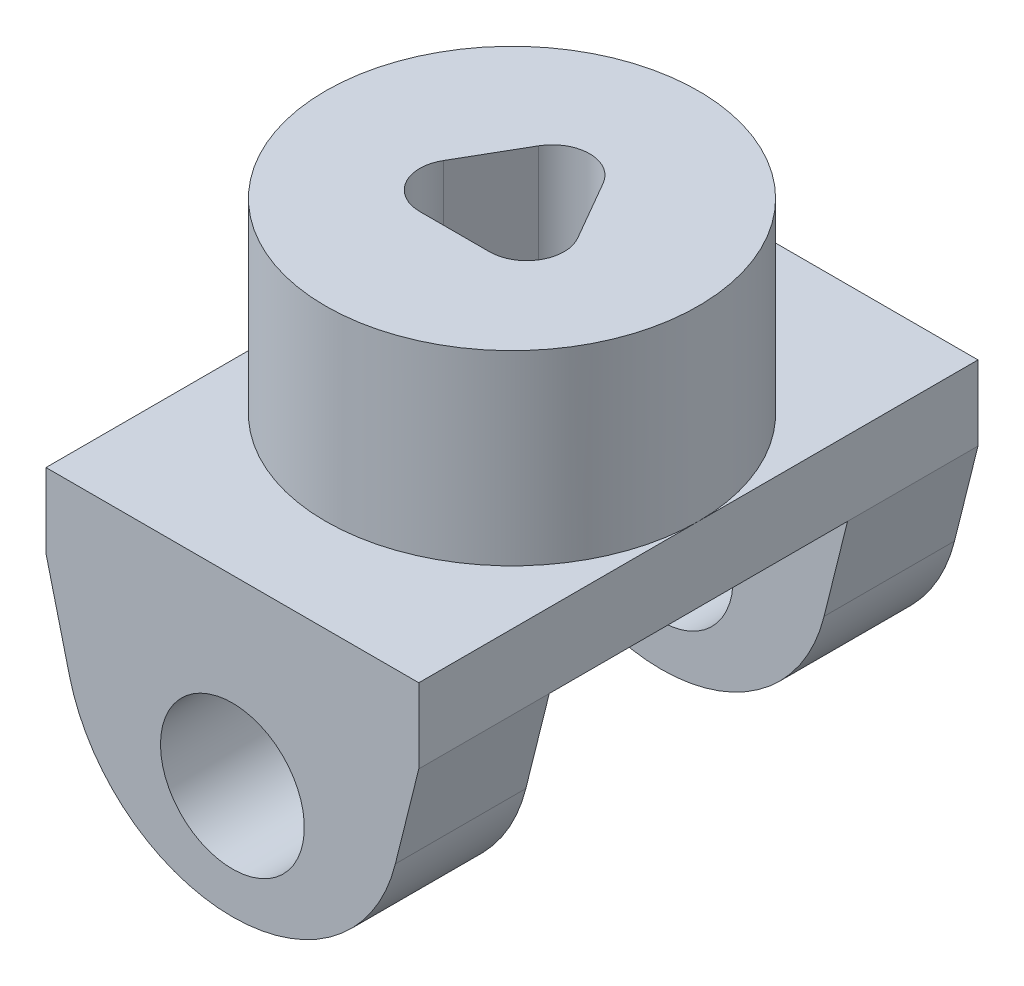
ISO-10303-21;
HEADER;
FILE_DESCRIPTION(('STEP AP214'),'2;1');
FILE_NAME('part.step','',(''),(''),'','','');
FILE_SCHEMA(('AUTOMOTIVE_DESIGN { 1 0 10303 214 1 1 1 1 }'));
ENDSEC;
DATA;
#1=APPLICATION_CONTEXT('core data for automotive mechanical design processes');
#2=APPLICATION_PROTOCOL_DEFINITION('international standard','automotive_design',2000,#1);
#3=PRODUCT_CONTEXT('',#1,'mechanical');
#4=PRODUCT('Part','Part','',(#3));
#5=PRODUCT_RELATED_PRODUCT_CATEGORY('part','',(#4));
#6=PRODUCT_DEFINITION_FORMATION('','',#4);
#7=PRODUCT_DEFINITION_CONTEXT('part definition',#1,'design');
#8=PRODUCT_DEFINITION('design','',#6,#7);
#9=PRODUCT_DEFINITION_SHAPE('','',#8);
#10=(LENGTH_UNIT() NAMED_UNIT(*) SI_UNIT(.MILLI.,.METRE.));
#11=(NAMED_UNIT(*) PLANE_ANGLE_UNIT() SI_UNIT($,.RADIAN.));
#12=(NAMED_UNIT(*) SI_UNIT($,.STERADIAN.) SOLID_ANGLE_UNIT());
#13=UNCERTAINTY_MEASURE_WITH_UNIT(LENGTH_MEASURE(1.E-05),#10,'distance_accuracy_value','');
#14=(GEOMETRIC_REPRESENTATION_CONTEXT(3) GLOBAL_UNCERTAINTY_ASSIGNED_CONTEXT((#13)) GLOBAL_UNIT_ASSIGNED_CONTEXT((#10,
#11,#12)) REPRESENTATION_CONTEXT('',''));
#15=CARTESIAN_POINT('',(0.,0.,0.));
#16=DIRECTION('',(0.,0.,1.));
#17=DIRECTION('',(1.,0.,0.));
#18=AXIS2_PLACEMENT_3D('',#15,#16,#17);
#19=CARTESIAN_POINT('',(0.,-4.35985338605916,-64.6527008487924));
#20=DIRECTION('',(0.,0.,1.));
#21=DIRECTION('',(1.,0.,0.));
#22=AXIS2_PLACEMENT_3D('',#19,#20,#21);
#23=CYLINDRICAL_SURFACE('',#22,5.72111548098366);
#24=CARTESIAN_POINT('',(0.,-4.35985338605916,5.08));
#25=DIRECTION('',(0.,0.,1.));
#26=DIRECTION('',(0.,-1.,0.));
#27=AXIS2_PLACEMENT_3D('',#24,#25,#26);
#28=CIRCLE('',#27,5.72111548098366);
#29=CARTESIAN_POINT('',(5.55117390072989,-5.74391648816334,5.08));
#30=VERTEX_POINT('',#29);
#31=CARTESIAN_POINT('',(-5.55117390072989,-5.74391648816334,5.08));
#32=VERTEX_POINT('',#31);
#33=EDGE_CURVE('E181',#30,#32,#28,.F.);
#34=ORIENTED_EDGE('',*,*,#33,.F.);
#35=DIRECTION('',(0.,0.,1.));
#36=VECTOR('',#35,1.);
#37=CARTESIAN_POINT('',(5.55117390072989,-5.74391648816334,-64.6527008487924));
#38=LINE('',#37,#36);
#39=CARTESIAN_POINT('',(5.55117390072989,-5.74391648816334,9.52500000000001));
#40=VERTEX_POINT('',#39);
#41=EDGE_CURVE('E180',#30,#40,#38,.T.);
#42=ORIENTED_EDGE('',*,*,#41,.T.);
#43=CARTESIAN_POINT('',(0.,-4.35985338605916,9.52500000000001));
#44=DIRECTION('',(0.,0.,1.));
#45=DIRECTION('',(1.,0.,0.));
#46=AXIS2_PLACEMENT_3D('',#43,#44,#45);
#47=CIRCLE('',#46,5.72111548098366);
#48=CARTESIAN_POINT('',(-5.55117390072989,-5.74391648816334,9.52500000000001));
#49=VERTEX_POINT('',#48);
#50=EDGE_CURVE('E232',#49,#40,#47,.T.);
#51=ORIENTED_EDGE('',*,*,#50,.F.);
#52=DIRECTION('',(0.,0.,1.));
#53=VECTOR('',#52,1.);
#54=CARTESIAN_POINT('',(-5.55117390072989,-5.74391648816334,-64.6527008487924));
#55=LINE('',#54,#53);
#56=EDGE_CURVE('E218',#32,#49,#55,.T.);
#57=ORIENTED_EDGE('',*,*,#56,.F.);
#58=EDGE_LOOP('',(#34,#42,#51,#57));
#59=FACE_BOUND('',#58,.T.);
#60=ADVANCED_FACE('F37',(#59),#23,.T.);
#61=CARTESIAN_POINT('',(-5.55117390072989,-5.74391648816334,-64.6527008487924));
#62=DIRECTION('',(-0.970295726275996,-0.241921895599668,0.));
#63=DIRECTION('',(0.241921895599668,-0.970295726275996,0.));
#64=AXIS2_PLACEMENT_3D('',#61,#62,#63);
#65=PLANE('',#64);
#66=DIRECTION('',(-0.241921895599668,0.970295726275996,0.));
#67=VECTOR('',#66,1.);
#68=CARTESIAN_POINT('',(-5.55117390072989,-5.74391648816335,5.08));
#69=LINE('',#68,#67);
#70=CARTESIAN_POINT('',(-6.35,-2.54,5.08));
#71=VERTEX_POINT('',#70);
#72=EDGE_CURVE('E165',#32,#71,#69,.T.);
#73=ORIENTED_EDGE('',*,*,#72,.F.);
#74=ORIENTED_EDGE('',*,*,#56,.T.);
#75=DIRECTION('',(0.241921895599668,-0.970295726275996,0.));
#76=VECTOR('',#75,1.);
#77=CARTESIAN_POINT('',(-4.56131334578575,-9.71403032879251,9.525));
#78=LINE('',#77,#76);
#79=CARTESIAN_POINT('',(-6.35,-2.54,9.52500000000001));
#80=VERTEX_POINT('',#79);
#81=EDGE_CURVE('E229',#80,#49,#78,.T.);
#82=ORIENTED_EDGE('',*,*,#81,.F.);
#83=DIRECTION('',(0.,0.,1.));
#84=VECTOR('',#83,1.);
#85=CARTESIAN_POINT('',(-6.35,-2.54,-64.6527008487924));
#86=LINE('',#85,#84);
#87=EDGE_CURVE('E212',#71,#80,#86,.T.);
#88=ORIENTED_EDGE('',*,*,#87,.F.);
#89=EDGE_LOOP('',(#73,#74,#82,#88));
#90=FACE_BOUND('',#89,.T.);
#91=ADVANCED_FACE('F355',(#90),#65,.T.);
#92=CARTESIAN_POINT('',(5.55117390072989,-5.74391648816334,-64.6527008487924));
#93=DIRECTION('',(0.970295726275996,-0.241921895599668,0.));
#94=DIRECTION('',(0.241921895599668,0.970295726275996,0.));
#95=AXIS2_PLACEMENT_3D('',#92,#93,#94);
#96=PLANE('',#95);
#97=DIRECTION('',(-0.241921895599668,-0.970295726275996,0.));
#98=VECTOR('',#97,1.);
#99=CARTESIAN_POINT('',(5.55117390072989,-5.74391648816335,5.08));
#100=LINE('',#99,#98);
#101=CARTESIAN_POINT('',(6.35,-2.54,5.08));
#102=VERTEX_POINT('',#101);
#103=EDGE_CURVE('E162',#102,#30,#100,.T.);
#104=ORIENTED_EDGE('',*,*,#103,.F.);
#105=DIRECTION('',(0.,0.,-1.));
#106=VECTOR('',#105,1.);
#107=CARTESIAN_POINT('',(6.35,-2.53999999999999,9.525));
#108=LINE('',#107,#106);
#109=CARTESIAN_POINT('',(6.35,-2.54,9.52500000000001));
#110=VERTEX_POINT('',#109);
#111=EDGE_CURVE('E178',#110,#102,#108,.T.);
#112=ORIENTED_EDGE('',*,*,#111,.F.);
#113=DIRECTION('',(0.241921895599668,0.970295726275996,0.));
#114=VECTOR('',#113,1.);
#115=CARTESIAN_POINT('',(3.81803056043993,-12.6951747524829,9.525));
#116=LINE('',#115,#114);
#117=EDGE_CURVE('E227',#40,#110,#116,.T.);
#118=ORIENTED_EDGE('',*,*,#117,.F.);
#119=ORIENTED_EDGE('',*,*,#41,.F.);
#120=EDGE_LOOP('',(#104,#112,#118,#119));
#121=FACE_BOUND('',#120,.T.);
#122=ADVANCED_FACE('F176',(#121),#96,.T.);
#123=CARTESIAN_POINT('',(0.,-6.21975493695868,9.525));
#124=DIRECTION('',(0.,0.,-1.));
#125=DIRECTION('',(-1.,0.,0.));
#126=AXIS2_PLACEMENT_3D('',#123,#124,#125);
#127=CYLINDRICAL_SURFACE('',#126,2.4500078);
#128=CARTESIAN_POINT('',(0.,-6.21975493695868,5.08));
#129=DIRECTION('',(0.,0.,1.));
#130=DIRECTION('',(0.,-1.,0.));
#131=AXIS2_PLACEMENT_3D('',#128,#129,#130);
#132=CIRCLE('',#131,2.4500078);
#133=CARTESIAN_POINT('',(0.,-8.66976273695868,5.08));
#134=VERTEX_POINT('',#133);
#135=EDGE_CURVE('E41',#134,#134,#132,.F.);
#136=ORIENTED_EDGE('',*,*,#135,.T.);
#137=EDGE_LOOP('',(#136));
#138=FACE_BOUND('',#137,.T.);
#139=CARTESIAN_POINT('',(0.,-6.21975493695868,9.525));
#140=DIRECTION('',(0.,0.,-1.));
#141=DIRECTION('',(-1.,0.,0.));
#142=AXIS2_PLACEMENT_3D('',#139,#140,#141);
#143=CIRCLE('',#142,2.4500078);
#144=CARTESIAN_POINT('',(-2.4500078,-6.21975493695868,9.525));
#145=VERTEX_POINT('',#144);
#146=EDGE_CURVE('E209',#145,#145,#143,.T.);
#147=ORIENTED_EDGE('',*,*,#146,.F.);
#148=EDGE_LOOP('',(#147));
#149=FACE_BOUND('',#148,.T.);
#150=ADVANCED_FACE('F353',(#138,#149),#127,.F.);
#151=CARTESIAN_POINT('',(-6.35,-10.16,9.525));
#152=DIRECTION('',(0.,0.,1.));
#153=DIRECTION('',(1.,0.,0.));
#154=AXIS2_PLACEMENT_3D('',#151,#152,#153);
#155=PLANE('',#154);
#156=ORIENTED_EDGE('',*,*,#146,.T.);
#157=EDGE_LOOP('',(#156));
#158=FACE_BOUND('',#157,.T.);
#159=ORIENTED_EDGE('',*,*,#50,.T.);
#160=ORIENTED_EDGE('',*,*,#117,.T.);
#161=DIRECTION('',(0.,1.,0.));
#162=VECTOR('',#161,1.);
#163=CARTESIAN_POINT('',(6.35,-10.16,9.525));
#164=LINE('',#163,#162);
#165=CARTESIAN_POINT('',(6.35,0.,9.525));
#166=VERTEX_POINT('',#165);
#167=EDGE_CURVE('E186',#110,#166,#164,.T.);
#168=ORIENTED_EDGE('',*,*,#167,.T.);
#169=DIRECTION('',(1.,0.,0.));
#170=VECTOR('',#169,1.);
#171=CARTESIAN_POINT('',(-6.35,0.,9.525));
#172=LINE('',#171,#170);
#173=CARTESIAN_POINT('',(-6.35,0.,9.525));
#174=VERTEX_POINT('',#173);
#175=EDGE_CURVE('E271',#174,#166,#172,.T.);
#176=ORIENTED_EDGE('',*,*,#175,.F.);
#177=DIRECTION('',(0.,1.,0.));
#178=VECTOR('',#177,1.);
#179=CARTESIAN_POINT('',(-6.35,-10.16,9.525));
#180=LINE('',#179,#178);
#181=EDGE_CURVE('E294',#80,#174,#180,.T.);
#182=ORIENTED_EDGE('',*,*,#181,.F.);
#183=ORIENTED_EDGE('',*,*,#81,.T.);
#184=EDGE_LOOP('',(#159,#160,#168,#176,#182,#183));
#185=FACE_BOUND('',#184,.T.);
#186=ADVANCED_FACE('F326',(#158,#185),#155,.T.);
#187=CARTESIAN_POINT('',(-6.35,-10.16,9.525));
#188=DIRECTION('',(1.,0.,0.));
#189=DIRECTION('',(0.,0.,-1.));
#190=AXIS2_PLACEMENT_3D('',#187,#188,#189);
#191=PLANE('',#190);
#192=CARTESIAN_POINT('',(-6.35,-2.54,-9.525));
#193=VERTEX_POINT('',#192);
#194=CARTESIAN_POINT('',(-6.35,-2.54,-5.08));
#195=VERTEX_POINT('',#194);
#196=EDGE_CURVE('E215',#193,#195,#86,.T.);
#197=ORIENTED_EDGE('',*,*,#196,.T.);
#198=DIRECTION('',(0.,0.,1.));
#199=VECTOR('',#198,1.);
#200=CARTESIAN_POINT('',(-6.35,-2.54,5.08));
#201=LINE('',#200,#199);
#202=EDGE_CURVE('E172',#195,#71,#201,.T.);
#203=ORIENTED_EDGE('',*,*,#202,.T.);
#204=ORIENTED_EDGE('',*,*,#87,.T.);
#205=ORIENTED_EDGE('',*,*,#181,.T.);
#206=DIRECTION('',(0.,0.,-1.));
#207=VECTOR('',#206,1.);
#208=CARTESIAN_POINT('',(-6.35,0.,9.525));
#209=LINE('',#208,#207);
#210=CARTESIAN_POINT('',(-6.35,0.,0.));
#211=VERTEX_POINT('',#210);
#212=EDGE_CURVE('E291',#174,#211,#209,.T.);
#213=ORIENTED_EDGE('',*,*,#212,.T.);
#214=CARTESIAN_POINT('',(-6.35,0.,-9.525));
#215=VERTEX_POINT('',#214);
#216=EDGE_CURVE('E290',#211,#215,#209,.T.);
#217=ORIENTED_EDGE('',*,*,#216,.T.);
#218=DIRECTION('',(0.,1.,0.));
#219=VECTOR('',#218,1.);
#220=CARTESIAN_POINT('',(-6.35,-10.16,-9.525));
#221=LINE('',#220,#219);
#222=EDGE_CURVE('E297',#193,#215,#221,.T.);
#223=ORIENTED_EDGE('',*,*,#222,.F.);
#224=EDGE_LOOP('',(#197,#203,#204,#205,#213,#217,#223));
#225=FACE_BOUND('',#224,.T.);
#226=ADVANCED_FACE('F321',(#225),#191,.F.);
#227=CARTESIAN_POINT('',(-6.35,-10.16,-9.525));
#228=DIRECTION('',(0.,0.,1.));
#229=DIRECTION('',(1.,0.,0.));
#230=AXIS2_PLACEMENT_3D('',#227,#228,#229);
#231=PLANE('',#230);
#232=CARTESIAN_POINT('',(0.,-6.21975493695868,-9.525));
#233=DIRECTION('',(0.,0.,-1.));
#234=DIRECTION('',(-1.,0.,0.));
#235=AXIS2_PLACEMENT_3D('',#232,#233,#234);
#236=CIRCLE('',#235,2.4500078);
#237=CARTESIAN_POINT('',(-2.4500078,-6.21975493695868,-9.525));
#238=VERTEX_POINT('',#237);
#239=EDGE_CURVE('E208',#238,#238,#236,.T.);
#240=ORIENTED_EDGE('',*,*,#239,.F.);
#241=EDGE_LOOP('',(#240));
#242=FACE_BOUND('',#241,.T.);
#243=DIRECTION('',(0.241921895599668,0.970295726275996,0.));
#244=VECTOR('',#243,1.);
#245=CARTESIAN_POINT('',(3.81803056043993,-12.6951747524829,-9.525));
#246=LINE('',#245,#244);
#247=CARTESIAN_POINT('',(5.55117390072989,-5.74391648816334,-9.525));
#248=VERTEX_POINT('',#247);
#249=CARTESIAN_POINT('',(6.35,-2.53999999999999,-9.525));
#250=VERTEX_POINT('',#249);
#251=EDGE_CURVE('E225',#248,#250,#246,.T.);
#252=ORIENTED_EDGE('',*,*,#251,.F.);
#253=CARTESIAN_POINT('',(0.,-4.35985338605916,-9.525));
#254=DIRECTION('',(0.,0.,1.));
#255=DIRECTION('',(1.,0.,0.));
#256=AXIS2_PLACEMENT_3D('',#253,#254,#255);
#257=CIRCLE('',#256,5.72111548098366);
#258=CARTESIAN_POINT('',(-5.55117390072989,-5.74391648816334,-9.525));
#259=VERTEX_POINT('',#258);
#260=EDGE_CURVE('E11',#259,#248,#257,.T.);
#261=ORIENTED_EDGE('',*,*,#260,.F.);
#262=DIRECTION('',(0.241921895599668,-0.970295726275996,0.));
#263=VECTOR('',#262,1.);
#264=CARTESIAN_POINT('',(-4.56131334578575,-9.71403032879251,-9.525));
#265=LINE('',#264,#263);
#266=EDGE_CURVE('E46',#193,#259,#265,.T.);
#267=ORIENTED_EDGE('',*,*,#266,.F.);
#268=ORIENTED_EDGE('',*,*,#222,.T.);
#269=DIRECTION('',(1.,0.,0.));
#270=VECTOR('',#269,1.);
#271=CARTESIAN_POINT('',(-6.35,0.,-9.525));
#272=LINE('',#271,#270);
#273=CARTESIAN_POINT('',(6.35,0.,-9.525));
#274=VERTEX_POINT('',#273);
#275=EDGE_CURVE('E287',#215,#274,#272,.T.);
#276=ORIENTED_EDGE('',*,*,#275,.T.);
#277=DIRECTION('',(0.,1.,0.));
#278=VECTOR('',#277,1.);
#279=CARTESIAN_POINT('',(6.35,-10.16,-9.525));
#280=LINE('',#279,#278);
#281=EDGE_CURVE('E299',#250,#274,#280,.T.);
#282=ORIENTED_EDGE('',*,*,#281,.F.);
#283=EDGE_LOOP('',(#252,#261,#267,#268,#276,#282));
#284=FACE_BOUND('',#283,.T.);
#285=ADVANCED_FACE('F330',(#242,#284),#231,.F.);
#286=CARTESIAN_POINT('',(6.35,-10.16,9.525));
#287=DIRECTION('',(1.,0.,0.));
#288=DIRECTION('',(0.,0.,-1.));
#289=AXIS2_PLACEMENT_3D('',#286,#287,#288);
#290=PLANE('',#289);
#291=ORIENTED_EDGE('',*,*,#167,.F.);
#292=ORIENTED_EDGE('',*,*,#111,.T.);
#293=DIRECTION('',(0.,0.,1.));
#294=VECTOR('',#293,1.);
#295=CARTESIAN_POINT('',(6.35,-2.54,5.08));
#296=LINE('',#295,#294);
#297=CARTESIAN_POINT('',(6.35,-2.53999999999999,-5.08));
#298=VERTEX_POINT('',#297);
#299=EDGE_CURVE('E169',#298,#102,#296,.T.);
#300=ORIENTED_EDGE('',*,*,#299,.F.);
#301=EDGE_CURVE('E62',#298,#250,#108,.T.);
#302=ORIENTED_EDGE('',*,*,#301,.T.);
#303=ORIENTED_EDGE('',*,*,#281,.T.);
#304=DIRECTION('',(0.,0.,-1.));
#305=VECTOR('',#304,1.);
#306=CARTESIAN_POINT('',(6.35,0.,9.525));
#307=LINE('',#306,#305);
#308=CARTESIAN_POINT('',(6.35,0.,0.));
#309=VERTEX_POINT('',#308);
#310=EDGE_CURVE('E284',#309,#274,#307,.T.);
#311=ORIENTED_EDGE('',*,*,#310,.F.);
#312=EDGE_CURVE('E285',#166,#309,#307,.T.);
#313=ORIENTED_EDGE('',*,*,#312,.F.);
#314=EDGE_LOOP('',(#291,#292,#300,#302,#303,#311,#313));
#315=FACE_BOUND('',#314,.T.);
#316=ADVANCED_FACE('F184',(#315),#290,.T.);
#317=CARTESIAN_POINT('',(0.,6.35,0.));
#318=DIRECTION('',(0.,1.,0.));
#319=DIRECTION('',(0.,0.,1.));
#320=AXIS2_PLACEMENT_3D('',#317,#318,#319);
#321=PLANE('',#320);
#322=CARTESIAN_POINT('',(0.,6.35,0.));
#323=DIRECTION('',(0.,1.,0.));
#324=DIRECTION('',(0.,0.,1.));
#325=AXIS2_PLACEMENT_3D('',#322,#323,#324);
#326=CIRCLE('',#325,6.35);
#327=CARTESIAN_POINT('',(0.,6.35,6.35));
#328=VERTEX_POINT('',#327);
#329=EDGE_CURVE('E189',#328,#328,#326,.T.);
#330=ORIENTED_EDGE('',*,*,#329,.T.);
#331=EDGE_LOOP('',(#330));
#332=FACE_BOUND('',#331,.T.);
#333=DIRECTION('',(1.,0.,0.));
#334=VECTOR('',#333,1.);
#335=CARTESIAN_POINT('',(-1.1889953014548,6.35,1.95646675736011));
#336=LINE('',#335,#334);
#337=CARTESIAN_POINT('',(-1.1889953014548,6.35,1.95646675736011));
#338=VERTEX_POINT('',#337);
#339=CARTESIAN_POINT('',(1.1889953014548,6.35,1.95646675736011));
#340=VERTEX_POINT('',#339);
#341=EDGE_CURVE('E235',#338,#340,#336,.T.);
#342=ORIENTED_EDGE('',*,*,#341,.F.);
#343=CARTESIAN_POINT('',(-1.1889953014548,6.35,0.686466757360106));
#344=DIRECTION('',(0.,-1.,0.));
#345=DIRECTION('',(0.,0.,-1.));
#346=AXIS2_PLACEMENT_3D('',#343,#344,#345);
#347=CIRCLE('',#346,1.27);
#348=CARTESIAN_POINT('',(-2.28884756426103,6.35,0.051466757360101));
#349=VERTEX_POINT('',#348);
#350=EDGE_CURVE('E240',#338,#349,#347,.T.);
#351=ORIENTED_EDGE('',*,*,#350,.T.);
#352=DIRECTION('',(-0.500000000000004,0.,0.866025403784436));
#353=VECTOR('',#352,1.);
#354=CARTESIAN_POINT('',(-1.09985226280623,6.35,-2.00793351472027));
#355=LINE('',#354,#353);
#356=CARTESIAN_POINT('',(-1.09985226280623,6.35,-2.00793351472027));
#357=VERTEX_POINT('',#356);
#358=EDGE_CURVE('E264',#357,#349,#355,.T.);
#359=ORIENTED_EDGE('',*,*,#358,.F.);
#360=CARTESIAN_POINT('',(0.,6.35,-1.37293351472026));
#361=DIRECTION('',(0.,1.,0.));
#362=DIRECTION('',(0.,0.,1.));
#363=AXIS2_PLACEMENT_3D('',#360,#361,#362);
#364=CIRCLE('',#363,1.27);
#365=CARTESIAN_POINT('',(1.09985226280623,6.35,-2.00793351472027));
#366=VERTEX_POINT('',#365);
#367=EDGE_CURVE('E261',#366,#357,#364,.T.);
#368=ORIENTED_EDGE('',*,*,#367,.F.);
#369=DIRECTION('',(-0.500000000000004,0.,-0.866025403784436));
#370=VECTOR('',#369,1.);
#371=CARTESIAN_POINT('',(2.28884756426104,6.35,0.0514667573601001));
#372=LINE('',#371,#370);
#373=CARTESIAN_POINT('',(2.28884756426104,6.35,0.0514667573601001));
#374=VERTEX_POINT('',#373);
#375=EDGE_CURVE('E258',#374,#366,#372,.T.);
#376=ORIENTED_EDGE('',*,*,#375,.F.);
#377=CARTESIAN_POINT('',(1.1889953014548,6.35,0.686466757360106));
#378=DIRECTION('',(0.,-1.,0.));
#379=DIRECTION('',(0.,0.,-1.));
#380=AXIS2_PLACEMENT_3D('',#377,#378,#379);
#381=CIRCLE('',#380,1.27);
#382=EDGE_CURVE('E255',#374,#340,#381,.T.);
#383=ORIENTED_EDGE('',*,*,#382,.T.);
#384=EDGE_LOOP('',(#342,#351,#359,#368,#376,#383));
#385=FACE_BOUND('',#384,.T.);
#386=ADVANCED_FACE('F407',(#332,#385),#321,.T.);
#387=CARTESIAN_POINT('',(0.,6.35,0.));
#388=DIRECTION('',(0.,-1.,0.));
#389=DIRECTION('',(0.,0.,-1.));
#390=AXIS2_PLACEMENT_3D('',#387,#388,#389);
#391=CYLINDRICAL_SURFACE('',#390,6.35);
#392=ORIENTED_EDGE('',*,*,#329,.F.);
#393=EDGE_LOOP('',(#392));
#394=FACE_BOUND('',#393,.T.);
#395=CARTESIAN_POINT('',(0.,0.,0.));
#396=DIRECTION('',(0.,1.,0.));
#397=DIRECTION('',(0.,0.,1.));
#398=AXIS2_PLACEMENT_3D('',#395,#396,#397);
#399=CIRCLE('',#398,6.35);
#400=EDGE_CURVE('E191',#309,#211,#399,.T.);
#401=ORIENTED_EDGE('',*,*,#400,.T.);
#402=EDGE_CURVE('E296',#211,#309,#399,.T.);
#403=ORIENTED_EDGE('',*,*,#402,.T.);
#404=EDGE_LOOP('',(#401,#403));
#405=FACE_BOUND('',#404,.T.);
#406=ADVANCED_FACE('F39',(#394,#405),#391,.T.);
#407=CARTESIAN_POINT('',(0.,0.,0.));
#408=DIRECTION('',(0.,1.,0.));
#409=DIRECTION('',(0.,0.,1.));
#410=AXIS2_PLACEMENT_3D('',#407,#408,#409);
#411=PLANE('',#410);
#412=ORIENTED_EDGE('',*,*,#400,.F.);
#413=ORIENTED_EDGE('',*,*,#310,.T.);
#414=ORIENTED_EDGE('',*,*,#275,.F.);
#415=ORIENTED_EDGE('',*,*,#216,.F.);
#416=EDGE_LOOP('',(#412,#413,#414,#415));
#417=FACE_BOUND('',#416,.T.);
#418=ADVANCED_FACE('F317',(#417),#411,.T.);
#419=ORIENTED_EDGE('',*,*,#402,.F.);
#420=ORIENTED_EDGE('',*,*,#212,.F.);
#421=ORIENTED_EDGE('',*,*,#175,.T.);
#422=ORIENTED_EDGE('',*,*,#312,.T.);
#423=EDGE_LOOP('',(#419,#420,#421,#422));
#424=FACE_BOUND('',#423,.T.);
#425=ADVANCED_FACE('F311',(#424),#411,.T.);
#426=CARTESIAN_POINT('',(-1.1889953014548,-1.27,1.95646675736011));
#427=DIRECTION('',(0.,0.,1.));
#428=DIRECTION('',(1.,0.,0.));
#429=AXIS2_PLACEMENT_3D('',#426,#427,#428);
#430=PLANE('',#429);
#431=ORIENTED_EDGE('',*,*,#341,.T.);
#432=DIRECTION('',(0.,1.,0.));
#433=VECTOR('',#432,1.);
#434=CARTESIAN_POINT('',(1.1889953014548,-1.27,1.95646675736011));
#435=LINE('',#434,#433);
#436=CARTESIAN_POINT('',(1.1889953014548,-1.27,1.95646675736011));
#437=VERTEX_POINT('',#436);
#438=EDGE_CURVE('E253',#437,#340,#435,.T.);
#439=ORIENTED_EDGE('',*,*,#438,.F.);
#440=DIRECTION('',(1.,0.,0.));
#441=VECTOR('',#440,1.);
#442=CARTESIAN_POINT('',(-1.1889953014548,-1.27,1.95646675736011));
#443=LINE('',#442,#441);
#444=CARTESIAN_POINT('',(-1.1889953014548,-1.27,1.95646675736011));
#445=VERTEX_POINT('',#444);
#446=EDGE_CURVE('E236',#445,#437,#443,.T.);
#447=ORIENTED_EDGE('',*,*,#446,.F.);
#448=DIRECTION('',(0.,1.,0.));
#449=VECTOR('',#448,1.);
#450=CARTESIAN_POINT('',(-1.1889953014548,-1.27,1.95646675736011));
#451=LINE('',#450,#449);
#452=EDGE_CURVE('E269',#445,#338,#451,.T.);
#453=ORIENTED_EDGE('',*,*,#452,.T.);
#454=EDGE_LOOP('',(#431,#439,#447,#453));
#455=FACE_BOUND('',#454,.T.);
#456=ADVANCED_FACE('F383',(#455),#430,.F.);
#457=CARTESIAN_POINT('',(-1.1889953014548,-1.27,0.686466757360106));
#458=DIRECTION('',(0.,1.,0.));
#459=DIRECTION('',(0.,0.,1.));
#460=AXIS2_PLACEMENT_3D('',#457,#458,#459);
#461=CYLINDRICAL_SURFACE('',#460,1.27);
#462=ORIENTED_EDGE('',*,*,#350,.F.);
#463=ORIENTED_EDGE('',*,*,#452,.F.);
#464=CARTESIAN_POINT('',(-1.1889953014548,-1.27,0.686466757360106));
#465=DIRECTION('',(0.,-1.,0.));
#466=DIRECTION('',(0.,0.,-1.));
#467=AXIS2_PLACEMENT_3D('',#464,#465,#466);
#468=CIRCLE('',#467,1.27);
#469=CARTESIAN_POINT('',(-2.28884756426103,-1.27,0.051466757360101));
#470=VERTEX_POINT('',#469);
#471=EDGE_CURVE('E251',#445,#470,#468,.T.);
#472=ORIENTED_EDGE('',*,*,#471,.T.);
#473=DIRECTION('',(0.,1.,0.));
#474=VECTOR('',#473,1.);
#475=CARTESIAN_POINT('',(-2.28884756426103,-1.27,0.051466757360101));
#476=LINE('',#475,#474);
#477=EDGE_CURVE('E272',#470,#349,#476,.T.);
#478=ORIENTED_EDGE('',*,*,#477,.T.);
#479=EDGE_LOOP('',(#462,#463,#472,#478));
#480=FACE_BOUND('',#479,.T.);
#481=ADVANCED_FACE('F379',(#480),#461,.F.);
#482=CARTESIAN_POINT('',(-1.09985226280623,-1.27,-2.00793351472027));
#483=DIRECTION('',(-0.866025403784436,0.,-0.500000000000004));
#484=DIRECTION('',(-0.500000000000004,0.,0.866025403784436));
#485=AXIS2_PLACEMENT_3D('',#482,#483,#484);
#486=PLANE('',#485);
#487=ORIENTED_EDGE('',*,*,#358,.T.);
#488=ORIENTED_EDGE('',*,*,#477,.F.);
#489=DIRECTION('',(-0.500000000000004,0.,0.866025403784436));
#490=VECTOR('',#489,1.);
#491=CARTESIAN_POINT('',(-1.09985226280623,-1.27,-2.00793351472027));
#492=LINE('',#491,#490);
#493=CARTESIAN_POINT('',(-1.09985226280623,-1.27,-2.00793351472027));
#494=VERTEX_POINT('',#493);
#495=EDGE_CURVE('E248',#494,#470,#492,.T.);
#496=ORIENTED_EDGE('',*,*,#495,.F.);
#497=DIRECTION('',(0.,1.,0.));
#498=VECTOR('',#497,1.);
#499=CARTESIAN_POINT('',(-1.09985226280623,-1.27,-2.00793351472027));
#500=LINE('',#499,#498);
#501=EDGE_CURVE('E274',#494,#357,#500,.T.);
#502=ORIENTED_EDGE('',*,*,#501,.T.);
#503=EDGE_LOOP('',(#487,#488,#496,#502));
#504=FACE_BOUND('',#503,.T.);
#505=ADVANCED_FACE('F382',(#504),#486,.F.);
#506=CARTESIAN_POINT('',(0.,-1.27,-1.37293351472026));
#507=DIRECTION('',(0.,1.,0.));
#508=DIRECTION('',(0.,0.,1.));
#509=AXIS2_PLACEMENT_3D('',#506,#507,#508);
#510=CYLINDRICAL_SURFACE('',#509,1.27);
#511=ORIENTED_EDGE('',*,*,#367,.T.);
#512=ORIENTED_EDGE('',*,*,#501,.F.);
#513=CARTESIAN_POINT('',(0.,-1.27,-1.37293351472026));
#514=DIRECTION('',(0.,1.,0.));
#515=DIRECTION('',(0.,0.,1.));
#516=AXIS2_PLACEMENT_3D('',#513,#514,#515);
#517=CIRCLE('',#516,1.27);
#518=CARTESIAN_POINT('',(1.09985226280623,-1.27,-2.00793351472027));
#519=VERTEX_POINT('',#518);
#520=EDGE_CURVE('E245',#519,#494,#517,.T.);
#521=ORIENTED_EDGE('',*,*,#520,.F.);
#522=DIRECTION('',(0.,1.,0.));
#523=VECTOR('',#522,1.);
#524=CARTESIAN_POINT('',(1.09985226280623,-1.27,-2.00793351472027));
#525=LINE('',#524,#523);
#526=EDGE_CURVE('E276',#519,#366,#525,.T.);
#527=ORIENTED_EDGE('',*,*,#526,.T.);
#528=EDGE_LOOP('',(#511,#512,#521,#527));
#529=FACE_BOUND('',#528,.T.);
#530=ADVANCED_FACE('F387',(#529),#510,.F.);
#531=CARTESIAN_POINT('',(2.28884756426104,-1.27,0.0514667573601001));
#532=DIRECTION('',(0.866025403784436,0.,-0.500000000000004));
#533=DIRECTION('',(-0.500000000000004,0.,-0.866025403784436));
#534=AXIS2_PLACEMENT_3D('',#531,#532,#533);
#535=PLANE('',#534);
#536=ORIENTED_EDGE('',*,*,#375,.T.);
#537=ORIENTED_EDGE('',*,*,#526,.F.);
#538=DIRECTION('',(-0.500000000000004,0.,-0.866025403784436));
#539=VECTOR('',#538,1.);
#540=CARTESIAN_POINT('',(2.28884756426104,-1.27,0.0514667573601001));
#541=LINE('',#540,#539);
#542=CARTESIAN_POINT('',(2.28884756426104,-1.27,0.0514667573601001));
#543=VERTEX_POINT('',#542);
#544=EDGE_CURVE('E242',#543,#519,#541,.T.);
#545=ORIENTED_EDGE('',*,*,#544,.F.);
#546=DIRECTION('',(0.,1.,0.));
#547=VECTOR('',#546,1.);
#548=CARTESIAN_POINT('',(2.28884756426104,-1.27,0.0514667573601001));
#549=LINE('',#548,#547);
#550=EDGE_CURVE('E278',#543,#374,#549,.T.);
#551=ORIENTED_EDGE('',*,*,#550,.T.);
#552=EDGE_LOOP('',(#536,#537,#545,#551));
#553=FACE_BOUND('',#552,.T.);
#554=ADVANCED_FACE('F375',(#553),#535,.F.);
#555=CARTESIAN_POINT('',(1.1889953014548,-1.27,0.686466757360106));
#556=DIRECTION('',(0.,1.,0.));
#557=DIRECTION('',(0.,0.,1.));
#558=AXIS2_PLACEMENT_3D('',#555,#556,#557);
#559=CYLINDRICAL_SURFACE('',#558,1.27);
#560=ORIENTED_EDGE('',*,*,#382,.F.);
#561=ORIENTED_EDGE('',*,*,#550,.F.);
#562=CARTESIAN_POINT('',(1.1889953014548,-1.27,0.686466757360106));
#563=DIRECTION('',(0.,-1.,0.));
#564=DIRECTION('',(0.,0.,-1.));
#565=AXIS2_PLACEMENT_3D('',#562,#563,#564);
#566=CIRCLE('',#565,1.27);
#567=EDGE_CURVE('E239',#543,#437,#566,.T.);
#568=ORIENTED_EDGE('',*,*,#567,.T.);
#569=ORIENTED_EDGE('',*,*,#438,.T.);
#570=EDGE_LOOP('',(#560,#561,#568,#569));
#571=FACE_BOUND('',#570,.T.);
#572=ADVANCED_FACE('F370',(#571),#559,.F.);
#573=CARTESIAN_POINT('',(1.1889953014548,-1.27,0.686466757360106));
#574=DIRECTION('',(0.,-1.,0.));
#575=DIRECTION('',(0.,0.,-1.));
#576=AXIS2_PLACEMENT_3D('',#573,#574,#575);
#577=PLANE('',#576);
#578=ORIENTED_EDGE('',*,*,#446,.T.);
#579=ORIENTED_EDGE('',*,*,#567,.F.);
#580=ORIENTED_EDGE('',*,*,#544,.T.);
#581=ORIENTED_EDGE('',*,*,#520,.T.);
#582=ORIENTED_EDGE('',*,*,#495,.T.);
#583=ORIENTED_EDGE('',*,*,#471,.F.);
#584=EDGE_LOOP('',(#578,#579,#580,#581,#582,#583));
#585=FACE_BOUND('',#584,.T.);
#586=ADVANCED_FACE('F366',(#585),#577,.F.);
#587=CARTESIAN_POINT('',(0.,-4.35985338605916,-5.08));
#588=DIRECTION('',(0.,0.,-1.));
#589=DIRECTION('',(-1.,0.,0.));
#590=AXIS2_PLACEMENT_3D('',#587,#588,#589);
#591=CIRCLE('',#590,5.72111548098366);
#592=CARTESIAN_POINT('',(-5.55117390072989,-5.74391648816334,-5.08));
#593=VERTEX_POINT('',#592);
#594=CARTESIAN_POINT('',(5.55117390072989,-5.74391648816334,-5.08));
#595=VERTEX_POINT('',#594);
#596=EDGE_CURVE('E197',#593,#595,#591,.F.);
#597=ORIENTED_EDGE('',*,*,#596,.F.);
#598=EDGE_CURVE('E219',#259,#593,#55,.T.);
#599=ORIENTED_EDGE('',*,*,#598,.F.);
#600=ORIENTED_EDGE('',*,*,#260,.T.);
#601=EDGE_CURVE('E222',#248,#595,#38,.T.);
#602=ORIENTED_EDGE('',*,*,#601,.T.);
#603=EDGE_LOOP('',(#597,#599,#600,#602));
#604=FACE_BOUND('',#603,.T.);
#605=ADVANCED_FACE('F341',(#604),#23,.T.);
#606=DIRECTION('',(0.241921895599668,-0.970295726275996,0.));
#607=VECTOR('',#606,1.);
#608=CARTESIAN_POINT('',(-5.55117390072989,-5.74391648816334,-5.08));
#609=LINE('',#608,#607);
#610=EDGE_CURVE('E201',#195,#593,#609,.T.);
#611=ORIENTED_EDGE('',*,*,#610,.F.);
#612=ORIENTED_EDGE('',*,*,#196,.F.);
#613=ORIENTED_EDGE('',*,*,#266,.T.);
#614=ORIENTED_EDGE('',*,*,#598,.T.);
#615=EDGE_LOOP('',(#611,#612,#613,#614));
#616=FACE_BOUND('',#615,.T.);
#617=ADVANCED_FACE('F335',(#616),#65,.T.);
#618=DIRECTION('',(0.241921895599668,0.970295726275996,0.));
#619=VECTOR('',#618,1.);
#620=CARTESIAN_POINT('',(5.55117390072989,-5.74391648816334,-5.08));
#621=LINE('',#620,#619);
#622=EDGE_CURVE('E194',#595,#298,#621,.T.);
#623=ORIENTED_EDGE('',*,*,#622,.F.);
#624=ORIENTED_EDGE('',*,*,#601,.F.);
#625=ORIENTED_EDGE('',*,*,#251,.T.);
#626=ORIENTED_EDGE('',*,*,#301,.F.);
#627=EDGE_LOOP('',(#623,#624,#625,#626));
#628=FACE_BOUND('',#627,.T.);
#629=ADVANCED_FACE('F344',(#628),#96,.T.);
#630=CARTESIAN_POINT('',(0.,-6.21975493695868,-5.08));
#631=DIRECTION('',(0.,0.,-1.));
#632=DIRECTION('',(-1.,0.,0.));
#633=AXIS2_PLACEMENT_3D('',#630,#631,#632);
#634=CIRCLE('',#633,2.4500078);
#635=CARTESIAN_POINT('',(-2.4500078,-6.21975493695868,-5.08));
#636=VERTEX_POINT('',#635);
#637=EDGE_CURVE('E167',#636,#636,#634,.F.);
#638=ORIENTED_EDGE('',*,*,#637,.T.);
#639=EDGE_LOOP('',(#638));
#640=FACE_BOUND('',#639,.T.);
#641=ORIENTED_EDGE('',*,*,#239,.T.);
#642=EDGE_LOOP('',(#641));
#643=FACE_BOUND('',#642,.T.);
#644=ADVANCED_FACE('F346',(#640,#643),#127,.F.);
#645=CARTESIAN_POINT('',(-6.35,-2.54,5.08));
#646=DIRECTION('',(0.,0.,1.));
#647=DIRECTION('',(0.,-1.,0.));
#648=AXIS2_PLACEMENT_3D('',#645,#646,#647);
#649=PLANE('',#648);
#650=ORIENTED_EDGE('',*,*,#72,.T.);
#651=DIRECTION('',(1.,0.,0.));
#652=VECTOR('',#651,1.);
#653=CARTESIAN_POINT('',(-6.35,-2.54,5.08));
#654=LINE('',#653,#652);
#655=EDGE_CURVE('E158',#71,#102,#654,.T.);
#656=ORIENTED_EDGE('',*,*,#655,.T.);
#657=ORIENTED_EDGE('',*,*,#103,.T.);
#658=ORIENTED_EDGE('',*,*,#33,.T.);
#659=EDGE_LOOP('',(#650,#656,#657,#658));
#660=FACE_BOUND('',#659,.T.);
#661=ORIENTED_EDGE('',*,*,#135,.F.);
#662=EDGE_LOOP('',(#661));
#663=FACE_BOUND('',#662,.T.);
#664=ADVANCED_FACE('F159',(#660,#663),#649,.F.);
#665=CARTESIAN_POINT('',(-6.35,-14.6531807892032,-5.08));
#666=DIRECTION('',(0.,0.,-1.));
#667=DIRECTION('',(-1.,0.,0.));
#668=AXIS2_PLACEMENT_3D('',#665,#666,#667);
#669=PLANE('',#668);
#670=ORIENTED_EDGE('',*,*,#610,.T.);
#671=ORIENTED_EDGE('',*,*,#596,.T.);
#672=ORIENTED_EDGE('',*,*,#622,.T.);
#673=DIRECTION('',(1.,0.,0.));
#674=VECTOR('',#673,1.);
#675=CARTESIAN_POINT('',(-6.35,-2.54,-5.08));
#676=LINE('',#675,#674);
#677=EDGE_CURVE('E54',#195,#298,#676,.T.);
#678=ORIENTED_EDGE('',*,*,#677,.F.);
#679=EDGE_LOOP('',(#670,#671,#672,#678));
#680=FACE_BOUND('',#679,.T.);
#681=ORIENTED_EDGE('',*,*,#637,.F.);
#682=EDGE_LOOP('',(#681));
#683=FACE_BOUND('',#682,.T.);
#684=ADVANCED_FACE('F338',(#680,#683),#669,.F.);
#685=CARTESIAN_POINT('',(-6.35,-2.54,5.08));
#686=DIRECTION('',(0.,1.,0.));
#687=DIRECTION('',(0.,0.,1.));
#688=AXIS2_PLACEMENT_3D('',#685,#686,#687);
#689=PLANE('',#688);
#690=ORIENTED_EDGE('',*,*,#655,.F.);
#691=ORIENTED_EDGE('',*,*,#202,.F.);
#692=ORIENTED_EDGE('',*,*,#677,.T.);
#693=ORIENTED_EDGE('',*,*,#299,.T.);
#694=EDGE_LOOP('',(#690,#691,#692,#693));
#695=FACE_BOUND('',#694,.T.);
#696=ADVANCED_FACE('F170',(#695),#689,.F.);
#697=CLOSED_SHELL('',(#60,#91,#122,#150,#186,#226,#285,#316,#386,#406,#418,#425,#456,#481,#505,
#530,#554,#572,#586,#605,#617,#629,#644,#664,#684,#696));
#698=MANIFOLD_SOLID_BREP('B2',#697);
#699=ADVANCED_BREP_SHAPE_REPRESENTATION('',(#18,#698),#14);
#700=SHAPE_DEFINITION_REPRESENTATION(#9,#699);
ENDSEC;
END-ISO-10303-21;
